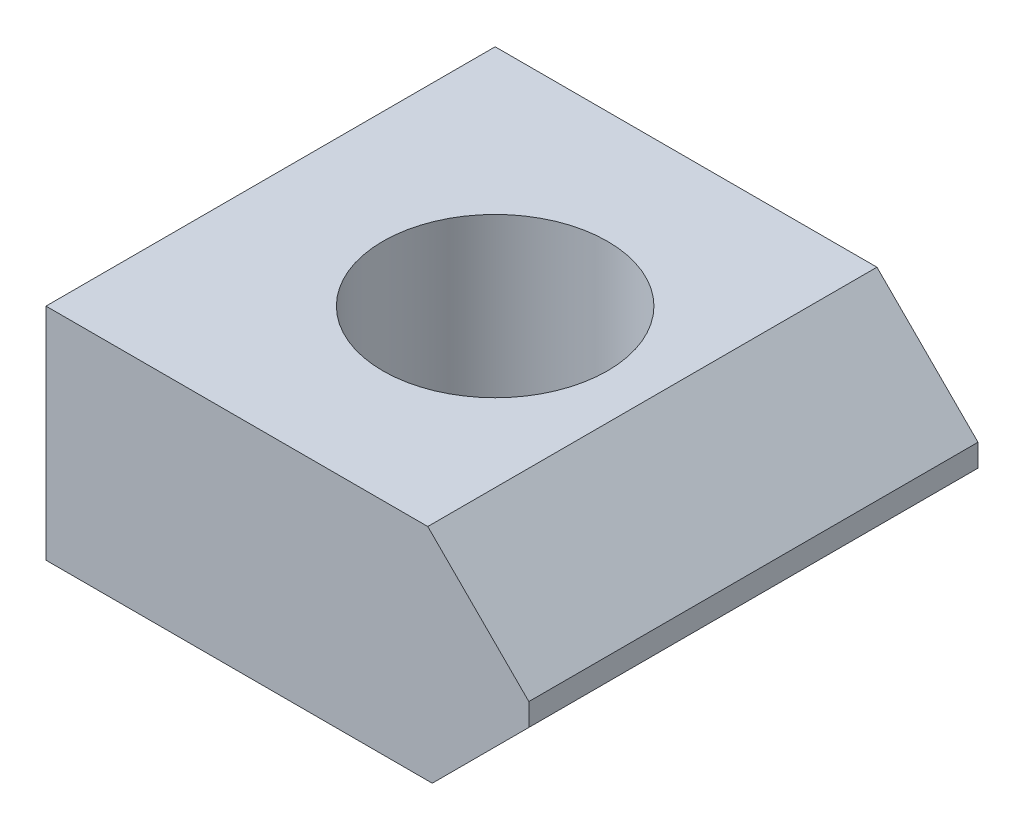
ISO-10303-21;
HEADER;
FILE_DESCRIPTION(('STEP AP214'),'2;1');
FILE_NAME('part.step','',(''),(''),'','','');
FILE_SCHEMA(('AUTOMOTIVE_DESIGN { 1 0 10303 214 1 1 1 1 }'));
ENDSEC;
DATA;
#1=APPLICATION_CONTEXT('core data for automotive mechanical design processes');
#2=APPLICATION_PROTOCOL_DEFINITION('international standard','automotive_design',2000,#1);
#3=PRODUCT_CONTEXT('',#1,'mechanical');
#4=PRODUCT('Part','Part','',(#3));
#5=PRODUCT_RELATED_PRODUCT_CATEGORY('part','',(#4));
#6=PRODUCT_DEFINITION_FORMATION('','',#4);
#7=PRODUCT_DEFINITION_CONTEXT('part definition',#1,'design');
#8=PRODUCT_DEFINITION('design','',#6,#7);
#9=PRODUCT_DEFINITION_SHAPE('','',#8);
#10=(LENGTH_UNIT() NAMED_UNIT(*) SI_UNIT(.MILLI.,.METRE.));
#11=(NAMED_UNIT(*) PLANE_ANGLE_UNIT() SI_UNIT($,.RADIAN.));
#12=(NAMED_UNIT(*) SI_UNIT($,.STERADIAN.) SOLID_ANGLE_UNIT());
#13=UNCERTAINTY_MEASURE_WITH_UNIT(LENGTH_MEASURE(1.E-05),#10,'distance_accuracy_value','');
#14=(GEOMETRIC_REPRESENTATION_CONTEXT(3) GLOBAL_UNCERTAINTY_ASSIGNED_CONTEXT((#13)) GLOBAL_UNIT_ASSIGNED_CONTEXT((#10,
#11,#12)) REPRESENTATION_CONTEXT('',''));
#15=CARTESIAN_POINT('',(0.,0.,0.));
#16=DIRECTION('',(0.,0.,1.));
#17=DIRECTION('',(1.,0.,0.));
#18=AXIS2_PLACEMENT_3D('',#15,#16,#17);
#19=CARTESIAN_POINT('',(17.,15.5,0.));
#20=DIRECTION('',(0.707106781186548,0.707106781186548,0.));
#21=DIRECTION('',(-0.707106781186548,0.707106781186548,0.));
#22=AXIS2_PLACEMENT_3D('',#19,#20,#21);
#23=PLANE('',#22);
#24=DIRECTION('',(0.,0.,-1.));
#25=VECTOR('',#24,1.);
#26=CARTESIAN_POINT('',(21.5,11.,20.));
#27=LINE('',#26,#25);
#28=CARTESIAN_POINT('',(21.4999999999999,11.,-20.));
#29=VERTEX_POINT('',#28);
#30=CARTESIAN_POINT('',(21.5,11.,20.));
#31=VERTEX_POINT('',#30);
#32=EDGE_CURVE('E80',#29,#31,#27,.F.);
#33=ORIENTED_EDGE('',*,*,#32,.F.);
#34=DIRECTION('',(0.707106781186547,-0.707106781186547,0.));
#35=VECTOR('',#34,1.);
#36=CARTESIAN_POINT('',(12.5,20.,-20.));
#37=LINE('',#36,#35);
#38=CARTESIAN_POINT('',(12.5,20.,-20.));
#39=VERTEX_POINT('',#38);
#40=EDGE_CURVE('E111',#39,#29,#37,.T.);
#41=ORIENTED_EDGE('',*,*,#40,.F.);
#42=DIRECTION('',(0.,0.,1.));
#43=VECTOR('',#42,1.);
#44=CARTESIAN_POINT('',(12.5,20.,0.));
#45=LINE('',#44,#43);
#46=CARTESIAN_POINT('',(12.5,20.,20.));
#47=VERTEX_POINT('',#46);
#48=EDGE_CURVE('E88',#47,#39,#45,.F.);
#49=ORIENTED_EDGE('',*,*,#48,.F.);
#50=DIRECTION('',(-0.707106781186547,0.707106781186547,0.));
#51=VECTOR('',#50,1.);
#52=CARTESIAN_POINT('',(21.5,11.,20.));
#53=LINE('',#52,#51);
#54=EDGE_CURVE('E73',#31,#47,#53,.T.);
#55=ORIENTED_EDGE('',*,*,#54,.F.);
#56=EDGE_LOOP('',(#33,#41,#49,#55));
#57=FACE_BOUND('',#56,.T.);
#58=ADVANCED_FACE('F24',(#57),#23,.T.);
#59=CARTESIAN_POINT('',(21.5,0.,20.));
#60=DIRECTION('',(1.,0.,0.));
#61=DIRECTION('',(0.,0.,-1.));
#62=AXIS2_PLACEMENT_3D('',#59,#60,#61);
#63=PLANE('',#62);
#64=DIRECTION('',(0.,1.,0.));
#65=VECTOR('',#64,1.);
#66=CARTESIAN_POINT('',(21.4999999999999,0.,-20.));
#67=LINE('',#66,#65);
#68=CARTESIAN_POINT('',(21.4999999999999,9.,-20.));
#69=VERTEX_POINT('',#68);
#70=EDGE_CURVE('E85',#29,#69,#67,.F.);
#71=ORIENTED_EDGE('',*,*,#70,.F.);
#72=ORIENTED_EDGE('',*,*,#32,.T.);
#73=DIRECTION('',(0.,1.,0.));
#74=VECTOR('',#73,1.);
#75=CARTESIAN_POINT('',(21.5,0.,20.));
#76=LINE('',#75,#74);
#77=CARTESIAN_POINT('',(21.5,9.,20.));
#78=VERTEX_POINT('',#77);
#79=EDGE_CURVE('E83',#78,#31,#76,.T.);
#80=ORIENTED_EDGE('',*,*,#79,.F.);
#81=DIRECTION('',(0.,0.,1.));
#82=VECTOR('',#81,1.);
#83=CARTESIAN_POINT('',(21.5,9.,0.));
#84=LINE('',#83,#82);
#85=EDGE_CURVE('E121',#69,#78,#84,.T.);
#86=ORIENTED_EDGE('',*,*,#85,.F.);
#87=EDGE_LOOP('',(#71,#72,#80,#86));
#88=FACE_BOUND('',#87,.T.);
#89=ADVANCED_FACE('F81',(#88),#63,.T.);
#90=CARTESIAN_POINT('',(0.,20.,0.));
#91=DIRECTION('',(0.,1.,0.));
#92=DIRECTION('',(0.,0.,1.));
#93=AXIS2_PLACEMENT_3D('',#90,#91,#92);
#94=PLANE('',#93);
#95=CARTESIAN_POINT('',(-1.5,20.,0.));
#96=DIRECTION('',(0.,1.,0.));
#97=DIRECTION('',(0.,0.,1.));
#98=AXIS2_PLACEMENT_3D('',#95,#96,#97);
#99=CIRCLE('',#98,10.);
#100=CARTESIAN_POINT('',(-1.5,20.,10.));
#101=VERTEX_POINT('',#100);
#102=EDGE_CURVE('E27',#101,#101,#99,.F.);
#103=ORIENTED_EDGE('',*,*,#102,.T.);
#104=EDGE_LOOP('',(#103));
#105=FACE_BOUND('',#104,.T.);
#106=DIRECTION('',(1.,0.,0.));
#107=VECTOR('',#106,1.);
#108=CARTESIAN_POINT('',(-21.5,20.,20.));
#109=LINE('',#108,#107);
#110=CARTESIAN_POINT('',(-21.5,20.,20.));
#111=VERTEX_POINT('',#110);
#112=EDGE_CURVE('E96',#47,#111,#109,.F.);
#113=ORIENTED_EDGE('',*,*,#112,.F.);
#114=ORIENTED_EDGE('',*,*,#48,.T.);
#115=DIRECTION('',(-1.,0.,0.));
#116=VECTOR('',#115,1.);
#117=CARTESIAN_POINT('',(21.4999999999999,20.,-20.));
#118=LINE('',#117,#116);
#119=CARTESIAN_POINT('',(-21.5,20.,-20.));
#120=VERTEX_POINT('',#119);
#121=EDGE_CURVE('E108',#120,#39,#118,.F.);
#122=ORIENTED_EDGE('',*,*,#121,.F.);
#123=DIRECTION('',(0.,0.,1.));
#124=VECTOR('',#123,1.);
#125=CARTESIAN_POINT('',(-21.5,20.,-20.));
#126=LINE('',#125,#124);
#127=EDGE_CURVE('E93',#111,#120,#126,.F.);
#128=ORIENTED_EDGE('',*,*,#127,.F.);
#129=EDGE_LOOP('',(#113,#114,#122,#128));
#130=FACE_BOUND('',#129,.T.);
#131=ADVANCED_FACE('F106',(#105,#130),#94,.T.);
#132=CARTESIAN_POINT('',(-21.5,0.,-20.));
#133=DIRECTION('',(-1.,0.,0.));
#134=DIRECTION('',(0.,0.,1.));
#135=AXIS2_PLACEMENT_3D('',#132,#133,#134);
#136=PLANE('',#135);
#137=DIRECTION('',(0.,1.,0.));
#138=VECTOR('',#137,1.);
#139=CARTESIAN_POINT('',(-21.5,0.,-20.));
#140=LINE('',#139,#138);
#141=CARTESIAN_POINT('',(-21.5,0.4,-20.));
#142=VERTEX_POINT('',#141);
#143=EDGE_CURVE('E113',#142,#120,#140,.T.);
#144=ORIENTED_EDGE('',*,*,#143,.F.);
#145=DIRECTION('',(0.,0.,1.));
#146=VECTOR('',#145,1.);
#147=CARTESIAN_POINT('',(-21.5,0.4,-20.));
#148=LINE('',#147,#146);
#149=CARTESIAN_POINT('',(-21.5,0.4,20.));
#150=VERTEX_POINT('',#149);
#151=EDGE_CURVE('E130',#142,#150,#148,.T.);
#152=ORIENTED_EDGE('',*,*,#151,.T.);
#153=DIRECTION('',(0.,1.,0.));
#154=VECTOR('',#153,1.);
#155=CARTESIAN_POINT('',(-21.5,0.,20.));
#156=LINE('',#155,#154);
#157=EDGE_CURVE('E98',#111,#150,#156,.F.);
#158=ORIENTED_EDGE('',*,*,#157,.F.);
#159=ORIENTED_EDGE('',*,*,#127,.T.);
#160=EDGE_LOOP('',(#144,#152,#158,#159));
#161=FACE_BOUND('',#160,.T.);
#162=ADVANCED_FACE('F134',(#161),#136,.T.);
#163=CARTESIAN_POINT('',(-21.5,0.,20.));
#164=DIRECTION('',(0.,0.,1.));
#165=DIRECTION('',(1.,0.,0.));
#166=AXIS2_PLACEMENT_3D('',#163,#164,#165);
#167=PLANE('',#166);
#168=ORIENTED_EDGE('',*,*,#157,.T.);
#169=DIRECTION('',(1.,0.,0.));
#170=VECTOR('',#169,1.);
#171=CARTESIAN_POINT('',(-29.9353006374,0.4,20.));
#172=LINE('',#171,#170);
#173=CARTESIAN_POINT('',(12.8999999999999,0.4,20.));
#174=VERTEX_POINT('',#173);
#175=EDGE_CURVE('E124',#150,#174,#172,.T.);
#176=ORIENTED_EDGE('',*,*,#175,.T.);
#177=DIRECTION('',(0.707106781186548,0.707106781186548,0.));
#178=VECTOR('',#177,1.);
#179=CARTESIAN_POINT('',(17.,4.5,20.));
#180=LINE('',#179,#178);
#181=EDGE_CURVE('E92',#78,#174,#180,.F.);
#182=ORIENTED_EDGE('',*,*,#181,.F.);
#183=ORIENTED_EDGE('',*,*,#79,.T.);
#184=ORIENTED_EDGE('',*,*,#54,.T.);
#185=ORIENTED_EDGE('',*,*,#112,.T.);
#186=EDGE_LOOP('',(#168,#176,#182,#183,#184,#185));
#187=FACE_BOUND('',#186,.T.);
#188=ADVANCED_FACE('F90',(#187),#167,.T.);
#189=CARTESIAN_POINT('',(17.,4.5,0.));
#190=DIRECTION('',(0.707106781186548,-0.707106781186548,0.));
#191=DIRECTION('',(0.707106781186548,0.707106781186548,0.));
#192=AXIS2_PLACEMENT_3D('',#189,#190,#191);
#193=PLANE('',#192);
#194=ORIENTED_EDGE('',*,*,#181,.T.);
#195=DIRECTION('',(0.,0.,1.));
#196=VECTOR('',#195,1.);
#197=CARTESIAN_POINT('',(12.9,0.4,-20.));
#198=LINE('',#197,#196);
#199=CARTESIAN_POINT('',(12.9,0.4,-20.));
#200=VERTEX_POINT('',#199);
#201=EDGE_CURVE('E132',#174,#200,#198,.F.);
#202=ORIENTED_EDGE('',*,*,#201,.T.);
#203=DIRECTION('',(-0.707106781186548,-0.707106781186548,0.));
#204=VECTOR('',#203,1.);
#205=CARTESIAN_POINT('',(21.4999999999999,9.,-20.));
#206=LINE('',#205,#204);
#207=EDGE_CURVE('E41',#69,#200,#206,.T.);
#208=ORIENTED_EDGE('',*,*,#207,.F.);
#209=ORIENTED_EDGE('',*,*,#85,.T.);
#210=EDGE_LOOP('',(#194,#202,#208,#209));
#211=FACE_BOUND('',#210,.T.);
#212=ADVANCED_FACE('F140',(#211),#193,.T.);
#213=CARTESIAN_POINT('',(21.4999999999999,0.,-20.));
#214=DIRECTION('',(0.,0.,-1.));
#215=DIRECTION('',(-1.,0.,0.));
#216=AXIS2_PLACEMENT_3D('',#213,#214,#215);
#217=PLANE('',#216);
#218=ORIENTED_EDGE('',*,*,#207,.T.);
#219=DIRECTION('',(1.,0.,0.));
#220=VECTOR('',#219,1.);
#221=CARTESIAN_POINT('',(-29.9353006374,0.4,-20.));
#222=LINE('',#221,#220);
#223=EDGE_CURVE('E33',#200,#142,#222,.F.);
#224=ORIENTED_EDGE('',*,*,#223,.T.);
#225=ORIENTED_EDGE('',*,*,#143,.T.);
#226=ORIENTED_EDGE('',*,*,#121,.T.);
#227=ORIENTED_EDGE('',*,*,#40,.T.);
#228=ORIENTED_EDGE('',*,*,#70,.T.);
#229=EDGE_LOOP('',(#218,#224,#225,#226,#227,#228));
#230=FACE_BOUND('',#229,.T.);
#231=ADVANCED_FACE('F110',(#230),#217,.T.);
#232=CARTESIAN_POINT('',(-1.5,20.,0.));
#233=DIRECTION('',(0.,1.,0.));
#234=DIRECTION('',(0.,0.,1.));
#235=AXIS2_PLACEMENT_3D('',#232,#233,#234);
#236=CYLINDRICAL_SURFACE('',#235,10.);
#237=ORIENTED_EDGE('',*,*,#102,.F.);
#238=EDGE_LOOP('',(#237));
#239=FACE_BOUND('',#238,.T.);
#240=CARTESIAN_POINT('',(-1.5,0.400000000000001,0.));
#241=DIRECTION('',(0.,1.,0.));
#242=DIRECTION('',(0.,0.,1.));
#243=AXIS2_PLACEMENT_3D('',#240,#241,#242);
#244=CIRCLE('',#243,10.);
#245=CARTESIAN_POINT('',(-1.5,0.400000000000001,10.));
#246=VERTEX_POINT('',#245);
#247=EDGE_CURVE('E13',#246,#246,#244,.F.);
#248=ORIENTED_EDGE('',*,*,#247,.T.);
#249=EDGE_LOOP('',(#248));
#250=FACE_BOUND('',#249,.T.);
#251=ADVANCED_FACE('F148',(#239,#250),#236,.F.);
#252=CARTESIAN_POINT('',(-29.9353006374,0.4,-20.));
#253=DIRECTION('',(0.,1.,0.));
#254=DIRECTION('',(0.,0.,1.));
#255=AXIS2_PLACEMENT_3D('',#252,#253,#254);
#256=PLANE('',#255);
#257=ORIENTED_EDGE('',*,*,#247,.F.);
#258=EDGE_LOOP('',(#257));
#259=FACE_BOUND('',#258,.T.);
#260=ORIENTED_EDGE('',*,*,#201,.F.);
#261=ORIENTED_EDGE('',*,*,#175,.F.);
#262=ORIENTED_EDGE('',*,*,#151,.F.);
#263=ORIENTED_EDGE('',*,*,#223,.F.);
#264=EDGE_LOOP('',(#260,#261,#262,#263));
#265=FACE_BOUND('',#264,.T.);
#266=ADVANCED_FACE('F129',(#259,#265),#256,.F.);
#267=CLOSED_SHELL('',(#58,#89,#131,#162,#188,#212,#231,#251,#266));
#268=MANIFOLD_SOLID_BREP('B1',#267);
#269=ADVANCED_BREP_SHAPE_REPRESENTATION('',(#18,#268),#14);
#270=SHAPE_DEFINITION_REPRESENTATION(#9,#269);
ENDSEC;
END-ISO-10303-21;
